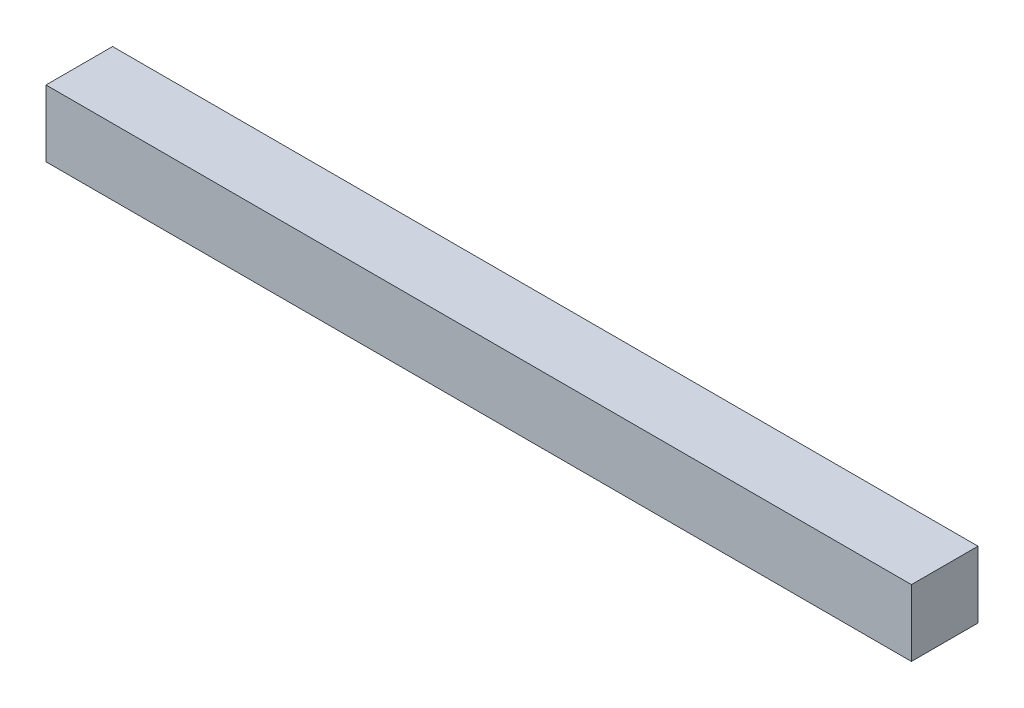
ISO-10303-21;
HEADER;
FILE_DESCRIPTION(('STEP AP214'),'2;1');
FILE_NAME('part.step','',(''),(''),'','','');
FILE_SCHEMA(('AUTOMOTIVE_DESIGN { 1 0 10303 214 1 1 1 1 }'));
ENDSEC;
DATA;
#1=APPLICATION_CONTEXT('core data for automotive mechanical design processes');
#2=APPLICATION_PROTOCOL_DEFINITION('international standard','automotive_design',2000,#1);
#3=PRODUCT_CONTEXT('',#1,'mechanical');
#4=PRODUCT('Part','Part','',(#3));
#5=PRODUCT_RELATED_PRODUCT_CATEGORY('part','',(#4));
#6=PRODUCT_DEFINITION_FORMATION('','',#4);
#7=PRODUCT_DEFINITION_CONTEXT('part definition',#1,'design');
#8=PRODUCT_DEFINITION('design','',#6,#7);
#9=PRODUCT_DEFINITION_SHAPE('','',#8);
#10=(LENGTH_UNIT() NAMED_UNIT(*) SI_UNIT(.MILLI.,.METRE.));
#11=(NAMED_UNIT(*) PLANE_ANGLE_UNIT() SI_UNIT($,.RADIAN.));
#12=(NAMED_UNIT(*) SI_UNIT($,.STERADIAN.) SOLID_ANGLE_UNIT());
#13=UNCERTAINTY_MEASURE_WITH_UNIT(LENGTH_MEASURE(1.E-05),#10,'distance_accuracy_value','');
#14=(GEOMETRIC_REPRESENTATION_CONTEXT(3) GLOBAL_UNCERTAINTY_ASSIGNED_CONTEXT((#13)) GLOBAL_UNIT_ASSIGNED_CONTEXT((#10,
#11,#12)) REPRESENTATION_CONTEXT('',''));
#15=CARTESIAN_POINT('',(0.,0.,0.));
#16=DIRECTION('',(0.,0.,1.));
#17=DIRECTION('',(1.,0.,0.));
#18=AXIS2_PLACEMENT_3D('',#15,#16,#17);
#19=CARTESIAN_POINT('',(165.1,25.4,12.7));
#20=DIRECTION('',(-1.,0.,0.));
#21=DIRECTION('',(0.,0.,1.));
#22=AXIS2_PLACEMENT_3D('',#19,#20,#21);
#23=PLANE('',#22);
#24=DIRECTION('',(0.,0.,-1.));
#25=VECTOR('',#24,1.);
#26=CARTESIAN_POINT('',(165.1,0.,12.7));
#27=LINE('',#26,#25);
#28=CARTESIAN_POINT('',(165.1,0.,12.7));
#29=VERTEX_POINT('',#28);
#30=CARTESIAN_POINT('',(165.1,0.,-12.7));
#31=VERTEX_POINT('',#30);
#32=EDGE_CURVE('E107',#29,#31,#27,.T.);
#33=ORIENTED_EDGE('',*,*,#32,.T.);
#34=DIRECTION('',(0.,-1.,0.));
#35=VECTOR('',#34,1.);
#36=CARTESIAN_POINT('',(165.1,25.4,-12.7));
#37=LINE('',#36,#35);
#38=CARTESIAN_POINT('',(165.1,25.4,-12.7));
#39=VERTEX_POINT('',#38);
#40=EDGE_CURVE('E11',#39,#31,#37,.T.);
#41=ORIENTED_EDGE('',*,*,#40,.F.);
#42=DIRECTION('',(0.,0.,-1.));
#43=VECTOR('',#42,1.);
#44=CARTESIAN_POINT('',(165.1,25.4,12.7));
#45=LINE('',#44,#43);
#46=CARTESIAN_POINT('',(165.1,25.4,12.7));
#47=VERTEX_POINT('',#46);
#48=EDGE_CURVE('E91',#47,#39,#45,.T.);
#49=ORIENTED_EDGE('',*,*,#48,.F.);
#50=DIRECTION('',(0.,-1.,0.));
#51=VECTOR('',#50,1.);
#52=CARTESIAN_POINT('',(165.1,25.4,12.7));
#53=LINE('',#52,#51);
#54=EDGE_CURVE('E103',#47,#29,#53,.T.);
#55=ORIENTED_EDGE('',*,*,#54,.T.);
#56=EDGE_LOOP('',(#33,#41,#49,#55));
#57=FACE_BOUND('',#56,.T.);
#58=ADVANCED_FACE('F39',(#57),#23,.F.);
#59=CARTESIAN_POINT('',(-165.1,25.4,-12.7));
#60=DIRECTION('',(0.,0.,1.));
#61=DIRECTION('',(1.,0.,0.));
#62=AXIS2_PLACEMENT_3D('',#59,#60,#61);
#63=PLANE('',#62);
#64=DIRECTION('',(-1.,0.,0.));
#65=VECTOR('',#64,1.);
#66=CARTESIAN_POINT('',(-165.1,0.,-12.7));
#67=LINE('',#66,#65);
#68=CARTESIAN_POINT('',(-165.1,0.,-12.7));
#69=VERTEX_POINT('',#68);
#70=EDGE_CURVE('E96',#31,#69,#67,.T.);
#71=ORIENTED_EDGE('',*,*,#70,.T.);
#72=DIRECTION('',(0.,-1.,0.));
#73=VECTOR('',#72,1.);
#74=CARTESIAN_POINT('',(-165.1,25.4,-12.7));
#75=LINE('',#74,#73);
#76=CARTESIAN_POINT('',(-165.1,25.4,-12.7));
#77=VERTEX_POINT('',#76);
#78=EDGE_CURVE('E48',#77,#69,#75,.T.);
#79=ORIENTED_EDGE('',*,*,#78,.F.);
#80=DIRECTION('',(-1.,0.,0.));
#81=VECTOR('',#80,1.);
#82=CARTESIAN_POINT('',(-165.1,25.4,-12.7));
#83=LINE('',#82,#81);
#84=EDGE_CURVE('E86',#39,#77,#83,.T.);
#85=ORIENTED_EDGE('',*,*,#84,.F.);
#86=ORIENTED_EDGE('',*,*,#40,.T.);
#87=EDGE_LOOP('',(#71,#79,#85,#86));
#88=FACE_BOUND('',#87,.T.);
#89=ADVANCED_FACE('F95',(#88),#63,.F.);
#90=CARTESIAN_POINT('',(-165.1,25.4,12.7));
#91=DIRECTION('',(1.,0.,0.));
#92=DIRECTION('',(0.,0.,-1.));
#93=AXIS2_PLACEMENT_3D('',#90,#91,#92);
#94=PLANE('',#93);
#95=DIRECTION('',(0.,0.,1.));
#96=VECTOR('',#95,1.);
#97=CARTESIAN_POINT('',(-165.1,0.,12.7));
#98=LINE('',#97,#96);
#99=CARTESIAN_POINT('',(-165.1,0.,12.7));
#100=VERTEX_POINT('',#99);
#101=EDGE_CURVE('E73',#69,#100,#98,.T.);
#102=ORIENTED_EDGE('',*,*,#101,.T.);
#103=DIRECTION('',(0.,-1.,0.));
#104=VECTOR('',#103,1.);
#105=CARTESIAN_POINT('',(-165.1,25.4,12.7));
#106=LINE('',#105,#104);
#107=CARTESIAN_POINT('',(-165.1,25.4,12.7));
#108=VERTEX_POINT('',#107);
#109=EDGE_CURVE('E98',#108,#100,#106,.T.);
#110=ORIENTED_EDGE('',*,*,#109,.F.);
#111=DIRECTION('',(0.,0.,1.));
#112=VECTOR('',#111,1.);
#113=CARTESIAN_POINT('',(-165.1,25.4,12.7));
#114=LINE('',#113,#112);
#115=EDGE_CURVE('E89',#77,#108,#114,.T.);
#116=ORIENTED_EDGE('',*,*,#115,.F.);
#117=ORIENTED_EDGE('',*,*,#78,.T.);
#118=EDGE_LOOP('',(#102,#110,#116,#117));
#119=FACE_BOUND('',#118,.T.);
#120=ADVANCED_FACE('F99',(#119),#94,.F.);
#121=CARTESIAN_POINT('',(-165.1,25.4,12.7));
#122=DIRECTION('',(0.,0.,-1.));
#123=DIRECTION('',(-1.,0.,0.));
#124=AXIS2_PLACEMENT_3D('',#121,#122,#123);
#125=PLANE('',#124);
#126=DIRECTION('',(1.,0.,0.));
#127=VECTOR('',#126,1.);
#128=CARTESIAN_POINT('',(-165.1,0.,12.7));
#129=LINE('',#128,#127);
#130=EDGE_CURVE('E79',#100,#29,#129,.T.);
#131=ORIENTED_EDGE('',*,*,#130,.T.);
#132=ORIENTED_EDGE('',*,*,#54,.F.);
#133=DIRECTION('',(1.,0.,0.));
#134=VECTOR('',#133,1.);
#135=CARTESIAN_POINT('',(-165.1,25.4,12.7));
#136=LINE('',#135,#134);
#137=EDGE_CURVE('E56',#108,#47,#136,.T.);
#138=ORIENTED_EDGE('',*,*,#137,.F.);
#139=ORIENTED_EDGE('',*,*,#109,.T.);
#140=EDGE_LOOP('',(#131,#132,#138,#139));
#141=FACE_BOUND('',#140,.T.);
#142=ADVANCED_FACE('F120',(#141),#125,.F.);
#143=CARTESIAN_POINT('',(0.,25.4,0.));
#144=DIRECTION('',(0.,-1.,0.));
#145=DIRECTION('',(0.,0.,-1.));
#146=AXIS2_PLACEMENT_3D('',#143,#144,#145);
#147=PLANE('',#146);
#148=ORIENTED_EDGE('',*,*,#48,.T.);
#149=ORIENTED_EDGE('',*,*,#84,.T.);
#150=ORIENTED_EDGE('',*,*,#115,.T.);
#151=ORIENTED_EDGE('',*,*,#137,.T.);
#152=EDGE_LOOP('',(#148,#149,#150,#151));
#153=FACE_BOUND('',#152,.T.);
#154=ADVANCED_FACE('F87',(#153),#147,.F.);
#155=CARTESIAN_POINT('',(0.,0.,0.));
#156=DIRECTION('',(0.,-1.,0.));
#157=DIRECTION('',(0.,0.,-1.));
#158=AXIS2_PLACEMENT_3D('',#155,#156,#157);
#159=PLANE('',#158);
#160=ORIENTED_EDGE('',*,*,#32,.F.);
#161=ORIENTED_EDGE('',*,*,#130,.F.);
#162=ORIENTED_EDGE('',*,*,#101,.F.);
#163=ORIENTED_EDGE('',*,*,#70,.F.);
#164=EDGE_LOOP('',(#160,#161,#162,#163));
#165=FACE_BOUND('',#164,.T.);
#166=ADVANCED_FACE('F123',(#165),#159,.T.);
#167=CLOSED_SHELL('',(#58,#89,#120,#142,#154,#166));
#168=MANIFOLD_SOLID_BREP('B2',#167);
#169=ADVANCED_BREP_SHAPE_REPRESENTATION('',(#18,#168),#14);
#170=SHAPE_DEFINITION_REPRESENTATION(#9,#169);
ENDSEC;
END-ISO-10303-21;
